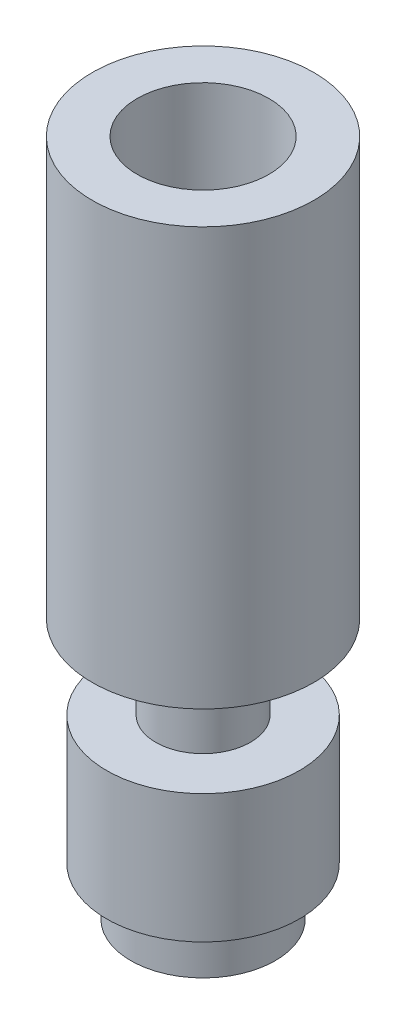
ISO-10303-21;
HEADER;
FILE_DESCRIPTION(('STEP AP214'),'2;1');
FILE_NAME('part.step','',(''),(''),'','','');
FILE_SCHEMA(('AUTOMOTIVE_DESIGN { 1 0 10303 214 1 1 1 1 }'));
ENDSEC;
DATA;
#1=APPLICATION_CONTEXT('core data for automotive mechanical design processes');
#2=APPLICATION_PROTOCOL_DEFINITION('international standard','automotive_design',2000,#1);
#3=PRODUCT_CONTEXT('',#1,'mechanical');
#4=PRODUCT('Part','Part','',(#3));
#5=PRODUCT_RELATED_PRODUCT_CATEGORY('part','',(#4));
#6=PRODUCT_DEFINITION_FORMATION('','',#4);
#7=PRODUCT_DEFINITION_CONTEXT('part definition',#1,'design');
#8=PRODUCT_DEFINITION('design','',#6,#7);
#9=PRODUCT_DEFINITION_SHAPE('','',#8);
#10=(LENGTH_UNIT() NAMED_UNIT(*) SI_UNIT(.MILLI.,.METRE.));
#11=(NAMED_UNIT(*) PLANE_ANGLE_UNIT() SI_UNIT($,.RADIAN.));
#12=(NAMED_UNIT(*) SI_UNIT($,.STERADIAN.) SOLID_ANGLE_UNIT());
#13=UNCERTAINTY_MEASURE_WITH_UNIT(LENGTH_MEASURE(1.E-05),#10,'distance_accuracy_value','');
#14=(GEOMETRIC_REPRESENTATION_CONTEXT(3) GLOBAL_UNCERTAINTY_ASSIGNED_CONTEXT((#13)) GLOBAL_UNIT_ASSIGNED_CONTEXT((#10,
#11,#12)) REPRESENTATION_CONTEXT('',''));
#15=CARTESIAN_POINT('',(0.,0.,0.));
#16=DIRECTION('',(0.,0.,1.));
#17=DIRECTION('',(1.,0.,0.));
#18=AXIS2_PLACEMENT_3D('',#15,#16,#17);
#19=CARTESIAN_POINT('',(0.,0.,0.));
#20=DIRECTION('',(0.,-1.,0.));
#21=DIRECTION('',(0.,0.,-1.));
#22=AXIS2_PLACEMENT_3D('',#19,#20,#21);
#23=CYLINDRICAL_SURFACE('',#22,1.);
#24=CARTESIAN_POINT('',(0.,16.5417050967555,0.));
#25=DIRECTION('',(0.,-1.,0.));
#26=DIRECTION('',(0.,0.,-1.));
#27=AXIS2_PLACEMENT_3D('',#24,#25,#26);
#28=CIRCLE('',#27,1.);
#29=CARTESIAN_POINT('',(0.,16.5417050967555,-1.));
#30=VERTEX_POINT('',#29);
#31=EDGE_CURVE('E10',#30,#30,#28,.T.);
#32=ORIENTED_EDGE('',*,*,#31,.F.);
#33=EDGE_LOOP('',(#32));
#34=FACE_BOUND('',#33,.T.);
#35=CARTESIAN_POINT('',(0.,0.,0.));
#36=DIRECTION('',(0.,-1.,0.));
#37=DIRECTION('',(0.,0.,-1.));
#38=AXIS2_PLACEMENT_3D('',#35,#36,#37);
#39=CIRCLE('',#38,1.);
#40=CARTESIAN_POINT('',(0.,0.,-1.));
#41=VERTEX_POINT('',#40);
#42=EDGE_CURVE('E73',#41,#41,#39,.T.);
#43=ORIENTED_EDGE('',*,*,#42,.T.);
#44=EDGE_LOOP('',(#43));
#45=FACE_BOUND('',#44,.T.);
#46=ADVANCED_FACE('F33',(#34,#45),#23,.F.);
#47=CARTESIAN_POINT('',(0.,16.5417050967555,0.));
#48=DIRECTION('',(0.,1.,0.));
#49=DIRECTION('',(0.,0.,1.));
#50=AXIS2_PLACEMENT_3D('',#47,#48,#49);
#51=CONICAL_SURFACE('',#50,1.,1.08210413623649);
#52=CARTESIAN_POINT('',(0.,17.1,0.));
#53=DIRECTION('',(0.,-1.,0.));
#54=DIRECTION('',(0.,0.,-1.));
#55=AXIS2_PLACEMENT_3D('',#52,#53,#54);
#56=CIRCLE('',#55,2.05);
#57=CARTESIAN_POINT('',(0.,17.1,-2.05));
#58=VERTEX_POINT('',#57);
#59=EDGE_CURVE('E39',#58,#58,#56,.T.);
#60=ORIENTED_EDGE('',*,*,#59,.F.);
#61=EDGE_LOOP('',(#60));
#62=FACE_BOUND('',#61,.T.);
#63=ORIENTED_EDGE('',*,*,#31,.T.);
#64=EDGE_LOOP('',(#63));
#65=FACE_BOUND('',#64,.T.);
#66=ADVANCED_FACE('F134',(#62,#65),#51,.F.);
#67=CARTESIAN_POINT('',(0.,0.,0.));
#68=DIRECTION('',(0.,-1.,0.));
#69=DIRECTION('',(0.,0.,-1.));
#70=AXIS2_PLACEMENT_3D('',#67,#68,#69);
#71=CYLINDRICAL_SURFACE('',#70,2.05);
#72=CARTESIAN_POINT('',(0.,21.1,0.));
#73=DIRECTION('',(0.,-1.,0.));
#74=DIRECTION('',(0.,0.,-1.));
#75=AXIS2_PLACEMENT_3D('',#72,#73,#74);
#76=CIRCLE('',#75,2.05);
#77=CARTESIAN_POINT('',(0.,21.1,-2.05));
#78=VERTEX_POINT('',#77);
#79=EDGE_CURVE('E43',#78,#78,#76,.T.);
#80=ORIENTED_EDGE('',*,*,#79,.F.);
#81=EDGE_LOOP('',(#80));
#82=FACE_BOUND('',#81,.T.);
#83=ORIENTED_EDGE('',*,*,#59,.T.);
#84=EDGE_LOOP('',(#83));
#85=FACE_BOUND('',#84,.T.);
#86=ADVANCED_FACE('F129',(#82,#85),#71,.F.);
#87=CARTESIAN_POINT('',(-2.05,21.1,0.));
#88=DIRECTION('',(0.,-1.,0.));
#89=DIRECTION('',(0.,0.,-1.));
#90=AXIS2_PLACEMENT_3D('',#87,#88,#89);
#91=PLANE('',#90);
#92=CARTESIAN_POINT('',(0.,21.1,0.));
#93=DIRECTION('',(0.,-1.,0.));
#94=DIRECTION('',(0.,0.,-1.));
#95=AXIS2_PLACEMENT_3D('',#92,#93,#94);
#96=CIRCLE('',#95,3.45);
#97=CARTESIAN_POINT('',(0.,21.1,-3.45));
#98=VERTEX_POINT('',#97);
#99=EDGE_CURVE('E47',#98,#98,#96,.T.);
#100=ORIENTED_EDGE('',*,*,#99,.F.);
#101=EDGE_LOOP('',(#100));
#102=FACE_BOUND('',#101,.T.);
#103=ORIENTED_EDGE('',*,*,#79,.T.);
#104=EDGE_LOOP('',(#103));
#105=FACE_BOUND('',#104,.T.);
#106=ADVANCED_FACE('F123',(#102,#105),#91,.F.);
#107=CARTESIAN_POINT('',(0.,0.,0.));
#108=DIRECTION('',(0.,-1.,0.));
#109=DIRECTION('',(0.,0.,-1.));
#110=AXIS2_PLACEMENT_3D('',#107,#108,#109);
#111=CYLINDRICAL_SURFACE('',#110,3.45);
#112=CARTESIAN_POINT('',(0.,8.1,0.));
#113=DIRECTION('',(0.,-1.,0.));
#114=DIRECTION('',(0.,0.,-1.));
#115=AXIS2_PLACEMENT_3D('',#112,#113,#114);
#116=CIRCLE('',#115,3.45);
#117=CARTESIAN_POINT('',(0.,8.1,-3.45));
#118=VERTEX_POINT('',#117);
#119=EDGE_CURVE('E52',#118,#118,#116,.T.);
#120=ORIENTED_EDGE('',*,*,#119,.F.);
#121=EDGE_LOOP('',(#120));
#122=FACE_BOUND('',#121,.T.);
#123=ORIENTED_EDGE('',*,*,#99,.T.);
#124=EDGE_LOOP('',(#123));
#125=FACE_BOUND('',#124,.T.);
#126=ADVANCED_FACE('F117',(#122,#125),#111,.T.);
#127=CARTESIAN_POINT('',(-1.475,8.1,0.));
#128=DIRECTION('',(0.,1.,0.));
#129=DIRECTION('',(0.,0.,1.));
#130=AXIS2_PLACEMENT_3D('',#127,#128,#129);
#131=PLANE('',#130);
#132=CARTESIAN_POINT('',(0.,8.1,0.));
#133=DIRECTION('',(0.,-1.,0.));
#134=DIRECTION('',(0.,0.,-1.));
#135=AXIS2_PLACEMENT_3D('',#132,#133,#134);
#136=CIRCLE('',#135,1.475);
#137=CARTESIAN_POINT('',(0.,8.1,-1.475));
#138=VERTEX_POINT('',#137);
#139=EDGE_CURVE('E55',#138,#138,#136,.T.);
#140=ORIENTED_EDGE('',*,*,#139,.F.);
#141=EDGE_LOOP('',(#140));
#142=FACE_BOUND('',#141,.T.);
#143=ORIENTED_EDGE('',*,*,#119,.T.);
#144=EDGE_LOOP('',(#143));
#145=FACE_BOUND('',#144,.T.);
#146=ADVANCED_FACE('F111',(#142,#145),#131,.F.);
#147=CARTESIAN_POINT('',(0.,0.,0.));
#148=DIRECTION('',(0.,-1.,0.));
#149=DIRECTION('',(0.,0.,-1.));
#150=AXIS2_PLACEMENT_3D('',#147,#148,#149);
#151=CYLINDRICAL_SURFACE('',#150,1.475);
#152=CARTESIAN_POINT('',(0.,5.5,0.));
#153=DIRECTION('',(0.,-1.,0.));
#154=DIRECTION('',(0.,0.,-1.));
#155=AXIS2_PLACEMENT_3D('',#152,#153,#154);
#156=CIRCLE('',#155,1.475);
#157=CARTESIAN_POINT('',(0.,5.5,-1.475));
#158=VERTEX_POINT('',#157);
#159=EDGE_CURVE('E58',#158,#158,#156,.T.);
#160=ORIENTED_EDGE('',*,*,#159,.F.);
#161=EDGE_LOOP('',(#160));
#162=FACE_BOUND('',#161,.T.);
#163=ORIENTED_EDGE('',*,*,#139,.T.);
#164=EDGE_LOOP('',(#163));
#165=FACE_BOUND('',#164,.T.);
#166=ADVANCED_FACE('F105',(#162,#165),#151,.T.);
#167=CARTESIAN_POINT('',(-3.,5.5,0.));
#168=DIRECTION('',(0.,-1.,0.));
#169=DIRECTION('',(0.,0.,-1.));
#170=AXIS2_PLACEMENT_3D('',#167,#168,#169);
#171=PLANE('',#170);
#172=CARTESIAN_POINT('',(0.,5.5,0.));
#173=DIRECTION('',(0.,-1.,0.));
#174=DIRECTION('',(0.,0.,-1.));
#175=AXIS2_PLACEMENT_3D('',#172,#173,#174);
#176=CIRCLE('',#175,3.);
#177=CARTESIAN_POINT('',(0.,5.5,-3.));
#178=VERTEX_POINT('',#177);
#179=EDGE_CURVE('E61',#178,#178,#176,.T.);
#180=ORIENTED_EDGE('',*,*,#179,.F.);
#181=EDGE_LOOP('',(#180));
#182=FACE_BOUND('',#181,.T.);
#183=ORIENTED_EDGE('',*,*,#159,.T.);
#184=EDGE_LOOP('',(#183));
#185=FACE_BOUND('',#184,.T.);
#186=ADVANCED_FACE('F99',(#182,#185),#171,.F.);
#187=CARTESIAN_POINT('',(0.,0.,0.));
#188=DIRECTION('',(0.,-1.,0.));
#189=DIRECTION('',(0.,0.,-1.));
#190=AXIS2_PLACEMENT_3D('',#187,#188,#189);
#191=CYLINDRICAL_SURFACE('',#190,3.);
#192=CARTESIAN_POINT('',(0.,1.5,0.));
#193=DIRECTION('',(0.,-1.,0.));
#194=DIRECTION('',(0.,0.,-1.));
#195=AXIS2_PLACEMENT_3D('',#192,#193,#194);
#196=CIRCLE('',#195,3.);
#197=CARTESIAN_POINT('',(0.,1.5,-3.));
#198=VERTEX_POINT('',#197);
#199=EDGE_CURVE('E64',#198,#198,#196,.T.);
#200=ORIENTED_EDGE('',*,*,#199,.F.);
#201=EDGE_LOOP('',(#200));
#202=FACE_BOUND('',#201,.T.);
#203=ORIENTED_EDGE('',*,*,#179,.T.);
#204=EDGE_LOOP('',(#203));
#205=FACE_BOUND('',#204,.T.);
#206=ADVANCED_FACE('F93',(#202,#205),#191,.T.);
#207=CARTESIAN_POINT('',(-2.25,1.5,0.));
#208=DIRECTION('',(0.,1.,0.));
#209=DIRECTION('',(0.,0.,1.));
#210=AXIS2_PLACEMENT_3D('',#207,#208,#209);
#211=PLANE('',#210);
#212=CARTESIAN_POINT('',(0.,1.5,0.));
#213=DIRECTION('',(0.,-1.,0.));
#214=DIRECTION('',(0.,0.,-1.));
#215=AXIS2_PLACEMENT_3D('',#212,#213,#214);
#216=CIRCLE('',#215,2.25);
#217=CARTESIAN_POINT('',(0.,1.5,-2.25));
#218=VERTEX_POINT('',#217);
#219=EDGE_CURVE('E67',#218,#218,#216,.T.);
#220=ORIENTED_EDGE('',*,*,#219,.F.);
#221=EDGE_LOOP('',(#220));
#222=FACE_BOUND('',#221,.T.);
#223=ORIENTED_EDGE('',*,*,#199,.T.);
#224=EDGE_LOOP('',(#223));
#225=FACE_BOUND('',#224,.T.);
#226=ADVANCED_FACE('F87',(#222,#225),#211,.F.);
#227=CARTESIAN_POINT('',(0.,0.,0.));
#228=DIRECTION('',(0.,-1.,0.));
#229=DIRECTION('',(0.,0.,-1.));
#230=AXIS2_PLACEMENT_3D('',#227,#228,#229);
#231=CYLINDRICAL_SURFACE('',#230,2.25);
#232=CARTESIAN_POINT('',(0.,0.,0.));
#233=DIRECTION('',(0.,-1.,0.));
#234=DIRECTION('',(0.,0.,-1.));
#235=AXIS2_PLACEMENT_3D('',#232,#233,#234);
#236=CIRCLE('',#235,2.25);
#237=CARTESIAN_POINT('',(0.,0.,-2.25));
#238=VERTEX_POINT('',#237);
#239=EDGE_CURVE('E70',#238,#238,#236,.T.);
#240=ORIENTED_EDGE('',*,*,#239,.F.);
#241=EDGE_LOOP('',(#240));
#242=FACE_BOUND('',#241,.T.);
#243=ORIENTED_EDGE('',*,*,#219,.T.);
#244=EDGE_LOOP('',(#243));
#245=FACE_BOUND('',#244,.T.);
#246=ADVANCED_FACE('F81',(#242,#245),#231,.T.);
#247=CARTESIAN_POINT('',(-1.,0.,0.));
#248=DIRECTION('',(0.,1.,0.));
#249=DIRECTION('',(0.,0.,1.));
#250=AXIS2_PLACEMENT_3D('',#247,#248,#249);
#251=PLANE('',#250);
#252=ORIENTED_EDGE('',*,*,#42,.F.);
#253=EDGE_LOOP('',(#252));
#254=FACE_BOUND('',#253,.T.);
#255=ORIENTED_EDGE('',*,*,#239,.T.);
#256=EDGE_LOOP('',(#255));
#257=FACE_BOUND('',#256,.T.);
#258=ADVANCED_FACE('F78',(#254,#257),#251,.F.);
#259=CLOSED_SHELL('',(#46,#66,#86,#106,#126,#146,#166,#186,#206,#226,#246,#258));
#260=MANIFOLD_SOLID_BREP('B2',#259);
#261=ADVANCED_BREP_SHAPE_REPRESENTATION('',(#18,#260),#14);
#262=SHAPE_DEFINITION_REPRESENTATION(#9,#261);
ENDSEC;
END-ISO-10303-21;
